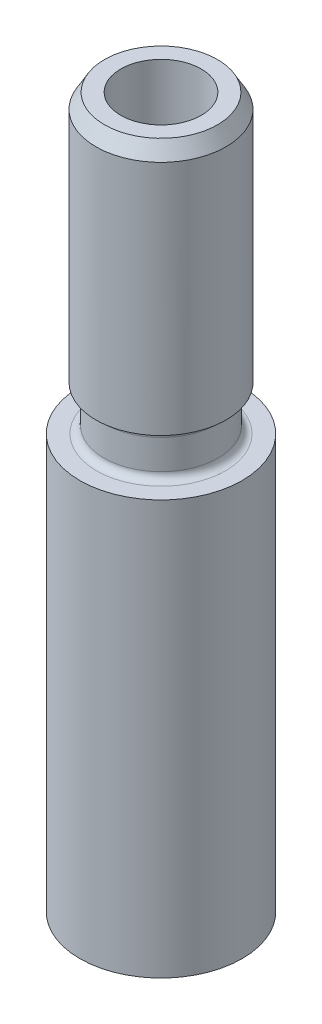
ISO-10303-21;
HEADER;
FILE_DESCRIPTION(('STEP AP214'),'2;1');
FILE_NAME('part.step','',(''),(''),'','','');
FILE_SCHEMA(('AUTOMOTIVE_DESIGN { 1 0 10303 214 1 1 1 1 }'));
ENDSEC;
DATA;
#1=APPLICATION_CONTEXT('core data for automotive mechanical design processes');
#2=APPLICATION_PROTOCOL_DEFINITION('international standard','automotive_design',2000,#1);
#3=PRODUCT_CONTEXT('',#1,'mechanical');
#4=PRODUCT('Part','Part','',(#3));
#5=PRODUCT_RELATED_PRODUCT_CATEGORY('part','',(#4));
#6=PRODUCT_DEFINITION_FORMATION('','',#4);
#7=PRODUCT_DEFINITION_CONTEXT('part definition',#1,'design');
#8=PRODUCT_DEFINITION('design','',#6,#7);
#9=PRODUCT_DEFINITION_SHAPE('','',#8);
#10=(LENGTH_UNIT() NAMED_UNIT(*) SI_UNIT(.MILLI.,.METRE.));
#11=(NAMED_UNIT(*) PLANE_ANGLE_UNIT() SI_UNIT($,.RADIAN.));
#12=(NAMED_UNIT(*) SI_UNIT($,.STERADIAN.) SOLID_ANGLE_UNIT());
#13=UNCERTAINTY_MEASURE_WITH_UNIT(LENGTH_MEASURE(1.E-05),#10,'distance_accuracy_value','');
#14=(GEOMETRIC_REPRESENTATION_CONTEXT(3) GLOBAL_UNCERTAINTY_ASSIGNED_CONTEXT((#13)) GLOBAL_UNIT_ASSIGNED_CONTEXT((#10,
#11,#12)) REPRESENTATION_CONTEXT('',''));
#15=CARTESIAN_POINT('',(0.,0.,0.));
#16=DIRECTION('',(0.,0.,1.));
#17=DIRECTION('',(1.,0.,0.));
#18=AXIS2_PLACEMENT_3D('',#15,#16,#17);
#19=CARTESIAN_POINT('',(0.,0.,0.));
#20=DIRECTION('',(0.,-1.,0.));
#21=DIRECTION('',(0.,0.,-1.));
#22=AXIS2_PLACEMENT_3D('',#19,#20,#21);
#23=PLANE('',#22);
#24=CARTESIAN_POINT('',(0.,0.,0.));
#25=DIRECTION('',(0.,-1.,0.));
#26=DIRECTION('',(0.,0.,-1.));
#27=AXIS2_PLACEMENT_3D('',#24,#25,#26);
#28=CIRCLE('',#27,4.3561);
#29=CARTESIAN_POINT('',(0.,0.,-4.3561));
#30=VERTEX_POINT('',#29);
#31=EDGE_CURVE('E56',#30,#30,#28,.T.);
#32=ORIENTED_EDGE('',*,*,#31,.T.);
#33=EDGE_LOOP('',(#32));
#34=FACE_BOUND('',#33,.T.);
#35=ADVANCED_FACE('F30',(#34),#23,.T.);
#36=CARTESIAN_POINT('',(0.,0.,0.));
#37=DIRECTION('',(0.,-1.,0.));
#38=DIRECTION('',(0.,0.,-1.));
#39=AXIS2_PLACEMENT_3D('',#36,#37,#38);
#40=CYLINDRICAL_SURFACE('',#39,4.3561);
#41=CARTESIAN_POINT('',(0.,22.225,0.));
#42=DIRECTION('',(0.,-1.,0.));
#43=DIRECTION('',(0.,0.,-1.));
#44=AXIS2_PLACEMENT_3D('',#41,#42,#43);
#45=CIRCLE('',#44,4.3561);
#46=CARTESIAN_POINT('',(0.,22.225,-4.3561));
#47=VERTEX_POINT('',#46);
#48=EDGE_CURVE('E59',#47,#47,#45,.T.);
#49=ORIENTED_EDGE('',*,*,#48,.T.);
#50=EDGE_LOOP('',(#49));
#51=FACE_BOUND('',#50,.T.);
#52=ORIENTED_EDGE('',*,*,#31,.F.);
#53=EDGE_LOOP('',(#52));
#54=FACE_BOUND('',#53,.T.);
#55=ADVANCED_FACE('F89',(#51,#54),#40,.T.);
#56=CARTESIAN_POINT('',(4.3561,22.225,0.));
#57=DIRECTION('',(0.,1.,0.));
#58=DIRECTION('',(0.,0.,1.));
#59=AXIS2_PLACEMENT_3D('',#56,#57,#58);
#60=PLANE('',#59);
#61=CARTESIAN_POINT('',(0.,22.225,0.));
#62=DIRECTION('',(0.,1.,0.));
#63=DIRECTION('',(0.,0.,1.));
#64=AXIS2_PLACEMENT_3D('',#61,#62,#63);
#65=CIRCLE('',#64,3.457575);
#66=CARTESIAN_POINT('',(0.,22.225,3.457575));
#67=VERTEX_POINT('',#66);
#68=EDGE_CURVE('E10',#67,#67,#65,.F.);
#69=ORIENTED_EDGE('',*,*,#68,.T.);
#70=EDGE_LOOP('',(#69));
#71=FACE_BOUND('',#70,.T.);
#72=ORIENTED_EDGE('',*,*,#48,.F.);
#73=EDGE_LOOP('',(#72));
#74=FACE_BOUND('',#73,.T.);
#75=ADVANCED_FACE('F95',(#71,#74),#60,.T.);
#76=CARTESIAN_POINT('',(0.,0.,0.));
#77=DIRECTION('',(0.,-1.,0.));
#78=DIRECTION('',(0.,0.,-1.));
#79=AXIS2_PLACEMENT_3D('',#76,#77,#78);
#80=CYLINDRICAL_SURFACE('',#79,3.0607);
#81=CARTESIAN_POINT('',(0.,24.209375,0.));
#82=DIRECTION('',(0.,-1.,0.));
#83=DIRECTION('',(0.,0.,-1.));
#84=AXIS2_PLACEMENT_3D('',#81,#82,#83);
#85=CIRCLE('',#84,3.0607);
#86=CARTESIAN_POINT('',(0.,24.209375,-3.0607));
#87=VERTEX_POINT('',#86);
#88=EDGE_CURVE('E41',#87,#87,#85,.T.);
#89=ORIENTED_EDGE('',*,*,#88,.T.);
#90=EDGE_LOOP('',(#89));
#91=FACE_BOUND('',#90,.T.);
#92=CARTESIAN_POINT('',(0.,22.621875,0.));
#93=DIRECTION('',(0.,1.,0.));
#94=DIRECTION('',(0.,0.,1.));
#95=AXIS2_PLACEMENT_3D('',#92,#93,#94);
#96=CIRCLE('',#95,3.0607);
#97=CARTESIAN_POINT('',(0.,22.621875,3.0607));
#98=VERTEX_POINT('',#97);
#99=EDGE_CURVE('E45',#98,#98,#96,.T.);
#100=ORIENTED_EDGE('',*,*,#99,.T.);
#101=EDGE_LOOP('',(#100));
#102=FACE_BOUND('',#101,.T.);
#103=ADVANCED_FACE('F108',(#91,#102),#80,.T.);
#104=CARTESIAN_POINT('',(3.0607,24.60625,0.));
#105=DIRECTION('',(0.,-1.,0.));
#106=DIRECTION('',(0.,0.,-1.));
#107=AXIS2_PLACEMENT_3D('',#104,#105,#106);
#108=PLANE('',#107);
#109=CARTESIAN_POINT('',(0.,24.60625,0.));
#110=DIRECTION('',(0.,-1.,0.));
#111=DIRECTION('',(0.,0.,-1.));
#112=AXIS2_PLACEMENT_3D('',#109,#110,#111);
#113=CIRCLE('',#112,3.457575);
#114=CARTESIAN_POINT('',(0.,24.60625,-3.457575));
#115=VERTEX_POINT('',#114);
#116=EDGE_CURVE('E37',#115,#115,#113,.F.);
#117=ORIENTED_EDGE('',*,*,#116,.T.);
#118=EDGE_LOOP('',(#117));
#119=FACE_BOUND('',#118,.T.);
#120=CARTESIAN_POINT('',(0.,24.60625,0.));
#121=DIRECTION('',(0.,-1.,0.));
#122=DIRECTION('',(0.,0.,-1.));
#123=AXIS2_PLACEMENT_3D('',#120,#121,#122);
#124=CIRCLE('',#123,3.4925);
#125=CARTESIAN_POINT('',(0.,24.60625,-3.4925));
#126=VERTEX_POINT('',#125);
#127=EDGE_CURVE('E62',#126,#126,#124,.T.);
#128=ORIENTED_EDGE('',*,*,#127,.T.);
#129=EDGE_LOOP('',(#128));
#130=FACE_BOUND('',#129,.T.);
#131=ADVANCED_FACE('F111',(#119,#130),#108,.T.);
#132=CARTESIAN_POINT('',(0.,0.,0.));
#133=DIRECTION('',(0.,-1.,0.));
#134=DIRECTION('',(0.,0.,-1.));
#135=AXIS2_PLACEMENT_3D('',#132,#133,#134);
#136=CYLINDRICAL_SURFACE('',#135,3.4925);
#137=CARTESIAN_POINT('',(0.,37.30625,0.));
#138=DIRECTION('',(0.,1.,0.));
#139=DIRECTION('',(0.,0.,1.));
#140=AXIS2_PLACEMENT_3D('',#137,#138,#139);
#141=CIRCLE('',#140,3.4925);
#142=CARTESIAN_POINT('',(0.,37.30625,3.4925));
#143=VERTEX_POINT('',#142);
#144=EDGE_CURVE('E53',#143,#143,#141,.F.);
#145=ORIENTED_EDGE('',*,*,#144,.T.);
#146=EDGE_LOOP('',(#145));
#147=FACE_BOUND('',#146,.T.);
#148=ORIENTED_EDGE('',*,*,#127,.F.);
#149=EDGE_LOOP('',(#148));
#150=FACE_BOUND('',#149,.T.);
#151=ADVANCED_FACE('F119',(#147,#150),#136,.T.);
#152=CARTESIAN_POINT('',(3.4925,38.1,0.));
#153=DIRECTION('',(0.,1.,0.));
#154=DIRECTION('',(0.,0.,1.));
#155=AXIS2_PLACEMENT_3D('',#152,#153,#154);
#156=PLANE('',#155);
#157=CARTESIAN_POINT('',(0.,38.1,0.));
#158=DIRECTION('',(0.,1.,0.));
#159=DIRECTION('',(0.,0.,1.));
#160=AXIS2_PLACEMENT_3D('',#157,#158,#159);
#161=CIRCLE('',#160,3.03422822383073);
#162=CARTESIAN_POINT('',(0.,38.1,3.03422822383073));
#163=VERTEX_POINT('',#162);
#164=EDGE_CURVE('E50',#163,#163,#161,.T.);
#165=ORIENTED_EDGE('',*,*,#164,.T.);
#166=EDGE_LOOP('',(#165));
#167=FACE_BOUND('',#166,.T.);
#168=CARTESIAN_POINT('',(0.,38.1,0.));
#169=DIRECTION('',(0.,-1.,0.));
#170=DIRECTION('',(0.,0.,-1.));
#171=AXIS2_PLACEMENT_3D('',#168,#169,#170);
#172=CIRCLE('',#171,2.159);
#173=CARTESIAN_POINT('',(0.,38.1,-2.159));
#174=VERTEX_POINT('',#173);
#175=EDGE_CURVE('E65',#174,#174,#172,.T.);
#176=ORIENTED_EDGE('',*,*,#175,.T.);
#177=EDGE_LOOP('',(#176));
#178=FACE_BOUND('',#177,.T.);
#179=ADVANCED_FACE('F86',(#167,#178),#156,.T.);
#180=CARTESIAN_POINT('',(0.,0.,0.));
#181=DIRECTION('',(0.,-1.,0.));
#182=DIRECTION('',(0.,0.,-1.));
#183=AXIS2_PLACEMENT_3D('',#180,#181,#182);
#184=CYLINDRICAL_SURFACE('',#183,2.159);
#185=CARTESIAN_POINT('',(0.,2.27323517547362,0.));
#186=DIRECTION('',(0.,-1.,0.));
#187=DIRECTION('',(0.,0.,-1.));
#188=AXIS2_PLACEMENT_3D('',#185,#186,#187);
#189=CIRCLE('',#188,2.159);
#190=CARTESIAN_POINT('',(0.,2.27323517547362,-2.159));
#191=VERTEX_POINT('',#190);
#192=EDGE_CURVE('E68',#191,#191,#189,.T.);
#193=ORIENTED_EDGE('',*,*,#192,.T.);
#194=EDGE_LOOP('',(#193));
#195=FACE_BOUND('',#194,.T.);
#196=ORIENTED_EDGE('',*,*,#175,.F.);
#197=EDGE_LOOP('',(#196));
#198=FACE_BOUND('',#197,.T.);
#199=ADVANCED_FACE('F72',(#195,#198),#184,.F.);
#200=CARTESIAN_POINT('',(2.159,2.27323517547362,0.));
#201=DIRECTION('',(0.,1.,0.));
#202=DIRECTION('',(0.,0.,1.));
#203=AXIS2_PLACEMENT_3D('',#200,#201,#202);
#204=PLANE('',#203);
#205=ORIENTED_EDGE('',*,*,#192,.F.);
#206=EDGE_LOOP('',(#205));
#207=FACE_BOUND('',#206,.T.);
#208=ADVANCED_FACE('F75',(#207),#204,.T.);
#209=CARTESIAN_POINT('',(0.,37.30625,0.));
#210=DIRECTION('',(0.,-1.,0.));
#211=DIRECTION('',(0.,0.,-1.));
#212=AXIS2_PLACEMENT_3D('',#209,#210,#211);
#213=CONICAL_SURFACE('',#212,3.4925,0.523598775598297);
#214=ORIENTED_EDGE('',*,*,#164,.F.);
#215=EDGE_LOOP('',(#214));
#216=FACE_BOUND('',#215,.T.);
#217=ORIENTED_EDGE('',*,*,#144,.F.);
#218=EDGE_LOOP('',(#217));
#219=FACE_BOUND('',#218,.T.);
#220=ADVANCED_FACE('F77',(#216,#219),#213,.T.);
#221=CARTESIAN_POINT('',(0.,24.209375,0.));
#222=DIRECTION('',(0.,-1.,0.));
#223=DIRECTION('',(0.,0.,-1.));
#224=AXIS2_PLACEMENT_3D('',#221,#222,#223);
#225=TOROIDAL_SURFACE('',#224,3.457575,0.396875);
#226=ORIENTED_EDGE('',*,*,#116,.F.);
#227=EDGE_LOOP('',(#226));
#228=FACE_BOUND('',#227,.T.);
#229=ORIENTED_EDGE('',*,*,#88,.F.);
#230=EDGE_LOOP('',(#229));
#231=FACE_BOUND('',#230,.T.);
#232=ADVANCED_FACE('F83',(#228,#231),#225,.F.);
#233=CARTESIAN_POINT('',(0.,22.621875,0.));
#234=DIRECTION('',(0.,1.,0.));
#235=DIRECTION('',(0.,0.,1.));
#236=AXIS2_PLACEMENT_3D('',#233,#234,#235);
#237=TOROIDAL_SURFACE('',#236,3.457575,0.396875);
#238=ORIENTED_EDGE('',*,*,#99,.F.);
#239=EDGE_LOOP('',(#238));
#240=FACE_BOUND('',#239,.T.);
#241=ORIENTED_EDGE('',*,*,#68,.F.);
#242=EDGE_LOOP('',(#241));
#243=FACE_BOUND('',#242,.T.);
#244=ADVANCED_FACE('F32',(#240,#243),#237,.F.);
#245=CLOSED_SHELL('',(#35,#55,#75,#103,#131,#151,#179,#199,#208,#220,#232,#244));
#246=MANIFOLD_SOLID_BREP('B2',#245);
#247=ADVANCED_BREP_SHAPE_REPRESENTATION('',(#18,#246),#14);
#248=SHAPE_DEFINITION_REPRESENTATION(#9,#247);
ENDSEC;
END-ISO-10303-21;
